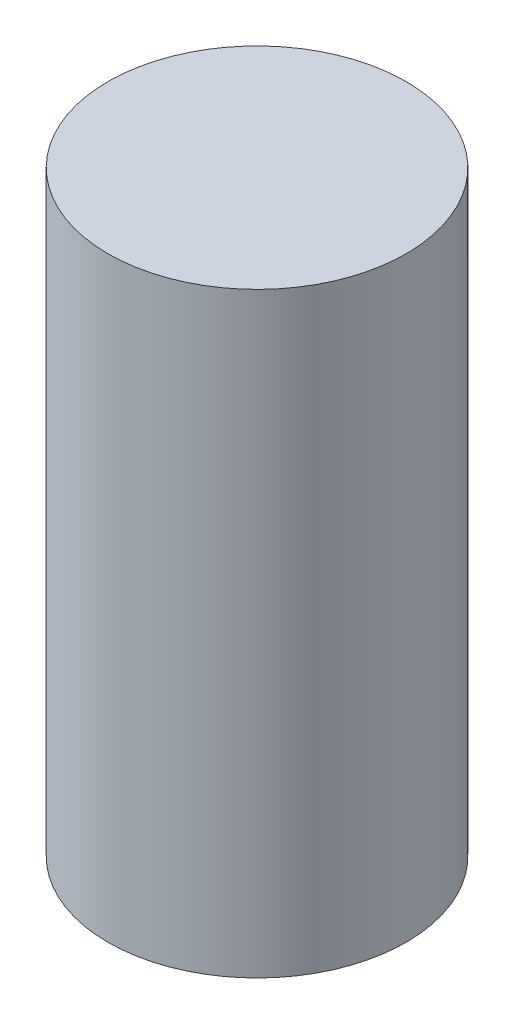
ISO-10303-21;
HEADER;
FILE_DESCRIPTION(('STEP AP214'),'2;1');
FILE_NAME('part.step','',(''),(''),'','','');
FILE_SCHEMA(('AUTOMOTIVE_DESIGN { 1 0 10303 214 1 1 1 1 }'));
ENDSEC;
DATA;
#1=APPLICATION_CONTEXT('core data for automotive mechanical design processes');
#2=APPLICATION_PROTOCOL_DEFINITION('international standard','automotive_design',2000,#1);
#3=PRODUCT_CONTEXT('',#1,'mechanical');
#4=PRODUCT('Part','Part','',(#3));
#5=PRODUCT_RELATED_PRODUCT_CATEGORY('part','',(#4));
#6=PRODUCT_DEFINITION_FORMATION('','',#4);
#7=PRODUCT_DEFINITION_CONTEXT('part definition',#1,'design');
#8=PRODUCT_DEFINITION('design','',#6,#7);
#9=PRODUCT_DEFINITION_SHAPE('','',#8);
#10=(LENGTH_UNIT() NAMED_UNIT(*) SI_UNIT(.MILLI.,.METRE.));
#11=(NAMED_UNIT(*) PLANE_ANGLE_UNIT() SI_UNIT($,.RADIAN.));
#12=(NAMED_UNIT(*) SI_UNIT($,.STERADIAN.) SOLID_ANGLE_UNIT());
#13=UNCERTAINTY_MEASURE_WITH_UNIT(LENGTH_MEASURE(1.E-05),#10,'distance_accuracy_value','');
#14=(GEOMETRIC_REPRESENTATION_CONTEXT(3) GLOBAL_UNCERTAINTY_ASSIGNED_CONTEXT((#13)) GLOBAL_UNIT_ASSIGNED_CONTEXT((#10,
#11,#12)) REPRESENTATION_CONTEXT('',''));
#15=CARTESIAN_POINT('',(0.,0.,0.));
#16=DIRECTION('',(0.,0.,1.));
#17=DIRECTION('',(1.,0.,0.));
#18=AXIS2_PLACEMENT_3D('',#15,#16,#17);
#19=CARTESIAN_POINT('',(0.,38.1,0.));
#20=DIRECTION('',(0.,-1.,0.));
#21=DIRECTION('',(0.,0.,-1.));
#22=AXIS2_PLACEMENT_3D('',#19,#20,#21);
#23=CYLINDRICAL_SURFACE('',#22,9.525);
#24=CARTESIAN_POINT('',(0.,38.1,0.));
#25=DIRECTION('',(0.,1.,0.));
#26=DIRECTION('',(0.,0.,1.));
#27=AXIS2_PLACEMENT_3D('',#24,#25,#26);
#28=CIRCLE('',#27,9.525);
#29=CARTESIAN_POINT('',(0.,38.1,9.525));
#30=VERTEX_POINT('',#29);
#31=EDGE_CURVE('E10',#30,#30,#28,.T.);
#32=ORIENTED_EDGE('',*,*,#31,.F.);
#33=EDGE_LOOP('',(#32));
#34=FACE_BOUND('',#33,.T.);
#35=CARTESIAN_POINT('',(0.,0.,0.));
#36=DIRECTION('',(0.,1.,0.));
#37=DIRECTION('',(0.,0.,1.));
#38=AXIS2_PLACEMENT_3D('',#35,#36,#37);
#39=CIRCLE('',#38,9.525);
#40=CARTESIAN_POINT('',(0.,0.,9.525));
#41=VERTEX_POINT('',#40);
#42=EDGE_CURVE('E18',#41,#41,#39,.T.);
#43=ORIENTED_EDGE('',*,*,#42,.T.);
#44=EDGE_LOOP('',(#43));
#45=FACE_BOUND('',#44,.T.);
#46=ADVANCED_FACE('F15',(#34,#45),#23,.T.);
#47=CARTESIAN_POINT('',(0.,38.1,0.));
#48=DIRECTION('',(0.,1.,0.));
#49=DIRECTION('',(0.,0.,1.));
#50=AXIS2_PLACEMENT_3D('',#47,#48,#49);
#51=PLANE('',#50);
#52=ORIENTED_EDGE('',*,*,#31,.T.);
#53=EDGE_LOOP('',(#52));
#54=FACE_BOUND('',#53,.T.);
#55=ADVANCED_FACE('F30',(#54),#51,.T.);
#56=CARTESIAN_POINT('',(0.,0.,0.));
#57=DIRECTION('',(0.,1.,0.));
#58=DIRECTION('',(0.,0.,1.));
#59=AXIS2_PLACEMENT_3D('',#56,#57,#58);
#60=PLANE('',#59);
#61=ORIENTED_EDGE('',*,*,#42,.F.);
#62=EDGE_LOOP('',(#61));
#63=FACE_BOUND('',#62,.T.);
#64=ADVANCED_FACE('F28',(#63),#60,.F.);
#65=CLOSED_SHELL('',(#46,#55,#64));
#66=MANIFOLD_SOLID_BREP('B1',#65);
#67=ADVANCED_BREP_SHAPE_REPRESENTATION('',(#18,#66),#14);
#68=SHAPE_DEFINITION_REPRESENTATION(#9,#67);
ENDSEC;
END-ISO-10303-21;
